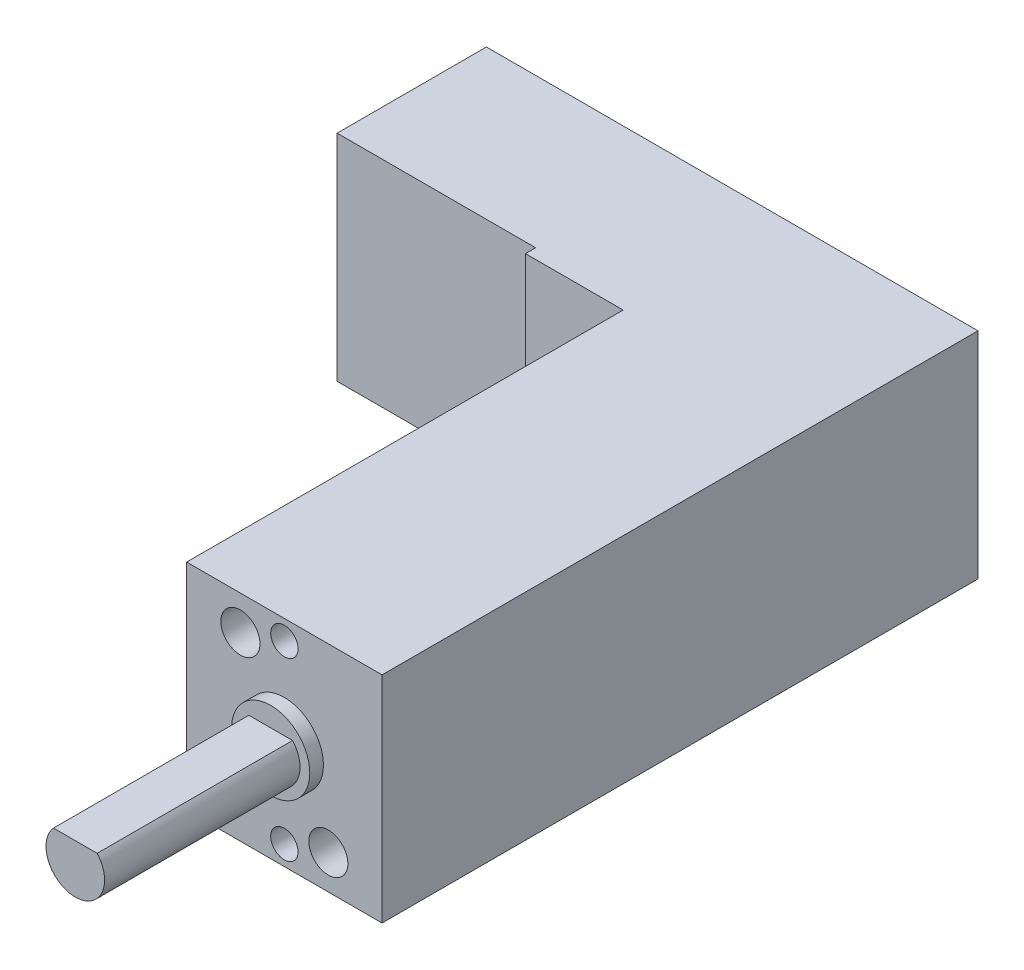
ISO-10303-21;
HEADER;
FILE_DESCRIPTION(('STEP AP214'),'2;1');
FILE_NAME('part.step','',(''),(''),'','','');
FILE_SCHEMA(('AUTOMOTIVE_DESIGN { 1 0 10303 214 1 1 1 1 }'));
ENDSEC;
DATA;
#1=APPLICATION_CONTEXT('core data for automotive mechanical design processes');
#2=APPLICATION_PROTOCOL_DEFINITION('international standard','automotive_design',2000,#1);
#3=PRODUCT_CONTEXT('',#1,'mechanical');
#4=PRODUCT('Part','Part','',(#3));
#5=PRODUCT_RELATED_PRODUCT_CATEGORY('part','',(#4));
#6=PRODUCT_DEFINITION_FORMATION('','',#4);
#7=PRODUCT_DEFINITION_CONTEXT('part definition',#1,'design');
#8=PRODUCT_DEFINITION('design','',#6,#7);
#9=PRODUCT_DEFINITION_SHAPE('','',#8);
#10=(LENGTH_UNIT() NAMED_UNIT(*) SI_UNIT(.MILLI.,.METRE.));
#11=(NAMED_UNIT(*) PLANE_ANGLE_UNIT() SI_UNIT($,.RADIAN.));
#12=(NAMED_UNIT(*) SI_UNIT($,.STERADIAN.) SOLID_ANGLE_UNIT());
#13=UNCERTAINTY_MEASURE_WITH_UNIT(LENGTH_MEASURE(1.E-05),#10,'distance_accuracy_value','');
#14=(GEOMETRIC_REPRESENTATION_CONTEXT(3) GLOBAL_UNCERTAINTY_ASSIGNED_CONTEXT((#13)) GLOBAL_UNIT_ASSIGNED_CONTEXT((#10,
#11,#12)) REPRESENTATION_CONTEXT('',''));
#15=CARTESIAN_POINT('',(0.,0.,0.));
#16=DIRECTION('',(0.,0.,1.));
#17=DIRECTION('',(1.,0.,0.));
#18=AXIS2_PLACEMENT_3D('',#15,#16,#17);
#19=CARTESIAN_POINT('',(-7.5,5.5,21.5));
#20=DIRECTION('',(1.,0.,0.));
#21=DIRECTION('',(0.,0.,-1.));
#22=AXIS2_PLACEMENT_3D('',#19,#20,#21);
#23=PLANE('',#22);
#24=DIRECTION('',(0.,0.,-1.));
#25=VECTOR('',#24,1.);
#26=CARTESIAN_POINT('',(-7.5,-5.5,21.5));
#27=LINE('',#26,#25);
#28=CARTESIAN_POINT('',(-7.5,-5.5,8.16000259983953));
#29=VERTEX_POINT('',#28);
#30=CARTESIAN_POINT('',(-7.5,-5.5,7.64));
#31=VERTEX_POINT('',#30);
#32=EDGE_CURVE('E51',#29,#31,#27,.T.);
#33=ORIENTED_EDGE('',*,*,#32,.F.);
#34=DIRECTION('',(0.,-1.,0.));
#35=VECTOR('',#34,1.);
#36=CARTESIAN_POINT('',(-7.5,19.7462461945696,8.16000259983953));
#37=LINE('',#36,#35);
#38=CARTESIAN_POINT('',(-7.5,5.5,8.16000259983953));
#39=VERTEX_POINT('',#38);
#40=EDGE_CURVE('E115',#39,#29,#37,.T.);
#41=ORIENTED_EDGE('',*,*,#40,.F.);
#42=DIRECTION('',(0.,0.,-1.));
#43=VECTOR('',#42,1.);
#44=CARTESIAN_POINT('',(-7.5,5.5,21.5));
#45=LINE('',#44,#43);
#46=CARTESIAN_POINT('',(-7.5,5.5,7.64));
#47=VERTEX_POINT('',#46);
#48=EDGE_CURVE('E133',#39,#47,#45,.T.);
#49=ORIENTED_EDGE('',*,*,#48,.T.);
#50=DIRECTION('',(0.,1.,0.));
#51=VECTOR('',#50,1.);
#52=CARTESIAN_POINT('',(-7.5,5.5,7.64));
#53=LINE('',#52,#51);
#54=EDGE_CURVE('E131',#31,#47,#53,.T.);
#55=ORIENTED_EDGE('',*,*,#54,.F.);
#56=EDGE_LOOP('',(#33,#41,#49,#55));
#57=FACE_BOUND('',#56,.T.);
#58=ADVANCED_FACE('F34',(#57),#23,.F.);
#59=CARTESIAN_POINT('',(-7.5,-5.5,21.5));
#60=DIRECTION('',(0.,1.,0.));
#61=DIRECTION('',(0.,0.,1.));
#62=AXIS2_PLACEMENT_3D('',#59,#60,#61);
#63=PLANE('',#62);
#64=DIRECTION('',(0.,0.,-1.));
#65=VECTOR('',#64,1.);
#66=CARTESIAN_POINT('',(-2.5,-5.5,30.5));
#67=LINE('',#66,#65);
#68=CARTESIAN_POINT('',(-2.5,-5.5,30.5));
#69=VERTEX_POINT('',#68);
#70=CARTESIAN_POINT('',(-2.5,-5.5,8.16000259983953));
#71=VERTEX_POINT('',#70);
#72=EDGE_CURVE('E127',#69,#71,#67,.T.);
#73=ORIENTED_EDGE('',*,*,#72,.T.);
#74=DIRECTION('',(1.,0.,0.));
#75=VECTOR('',#74,1.);
#76=CARTESIAN_POINT('',(-7.5,-5.5,8.16000259983953));
#77=LINE('',#76,#75);
#78=EDGE_CURVE('E118',#29,#71,#77,.T.);
#79=ORIENTED_EDGE('',*,*,#78,.F.);
#80=ORIENTED_EDGE('',*,*,#32,.T.);
#81=DIRECTION('',(1.,0.,0.));
#82=VECTOR('',#81,1.);
#83=CARTESIAN_POINT('',(-17.66,-5.5,7.64));
#84=LINE('',#83,#82);
#85=CARTESIAN_POINT('',(-17.66,-5.5,7.64));
#86=VERTEX_POINT('',#85);
#87=EDGE_CURVE('E194',#86,#31,#84,.T.);
#88=ORIENTED_EDGE('',*,*,#87,.F.);
#89=DIRECTION('',(0.,0.,1.));
#90=VECTOR('',#89,1.);
#91=CARTESIAN_POINT('',(-17.66,-5.5,0.));
#92=LINE('',#91,#90);
#93=CARTESIAN_POINT('',(-17.66,-5.5,0.));
#94=VERTEX_POINT('',#93);
#95=EDGE_CURVE('E185',#94,#86,#92,.T.);
#96=ORIENTED_EDGE('',*,*,#95,.F.);
#97=DIRECTION('',(1.,0.,0.));
#98=VECTOR('',#97,1.);
#99=CARTESIAN_POINT('',(-7.5,-5.5,0.));
#100=LINE('',#99,#98);
#101=CARTESIAN_POINT('',(7.5,-5.5,0.));
#102=VERTEX_POINT('',#101);
#103=EDGE_CURVE('E169',#94,#102,#100,.T.);
#104=ORIENTED_EDGE('',*,*,#103,.T.);
#105=DIRECTION('',(0.,0.,-1.));
#106=VECTOR('',#105,1.);
#107=CARTESIAN_POINT('',(7.5,-5.5,21.5));
#108=LINE('',#107,#106);
#109=CARTESIAN_POINT('',(7.5,-5.5,30.5));
#110=VERTEX_POINT('',#109);
#111=EDGE_CURVE('E38',#110,#102,#108,.T.);
#112=ORIENTED_EDGE('',*,*,#111,.F.);
#113=DIRECTION('',(1.,0.,0.));
#114=VECTOR('',#113,1.);
#115=CARTESIAN_POINT('',(-2.5,-5.5,30.5));
#116=LINE('',#115,#114);
#117=EDGE_CURVE('E163',#69,#110,#116,.T.);
#118=ORIENTED_EDGE('',*,*,#117,.F.);
#119=EDGE_LOOP('',(#73,#79,#80,#88,#96,#104,#112,#118));
#120=FACE_BOUND('',#119,.T.);
#121=ADVANCED_FACE('F36',(#120),#63,.F.);
#122=CARTESIAN_POINT('',(7.5,5.5,21.5));
#123=DIRECTION('',(-1.,0.,0.));
#124=DIRECTION('',(0.,0.,1.));
#125=AXIS2_PLACEMENT_3D('',#122,#123,#124);
#126=PLANE('',#125);
#127=DIRECTION('',(0.,1.,0.));
#128=VECTOR('',#127,1.);
#129=CARTESIAN_POINT('',(7.5,5.5,0.));
#130=LINE('',#129,#128);
#131=CARTESIAN_POINT('',(7.5,5.5,0.));
#132=VERTEX_POINT('',#131);
#133=EDGE_CURVE('E138',#102,#132,#130,.T.);
#134=ORIENTED_EDGE('',*,*,#133,.T.);
#135=DIRECTION('',(0.,0.,-1.));
#136=VECTOR('',#135,1.);
#137=CARTESIAN_POINT('',(7.5,5.5,21.5));
#138=LINE('',#137,#136);
#139=CARTESIAN_POINT('',(7.5,5.5,30.5));
#140=VERTEX_POINT('',#139);
#141=EDGE_CURVE('E136',#140,#132,#138,.T.);
#142=ORIENTED_EDGE('',*,*,#141,.F.);
#143=DIRECTION('',(0.,1.,0.));
#144=VECTOR('',#143,1.);
#145=CARTESIAN_POINT('',(7.5,-5.5,30.5));
#146=LINE('',#145,#144);
#147=EDGE_CURVE('E156',#110,#140,#146,.T.);
#148=ORIENTED_EDGE('',*,*,#147,.F.);
#149=ORIENTED_EDGE('',*,*,#111,.T.);
#150=EDGE_LOOP('',(#134,#142,#148,#149));
#151=FACE_BOUND('',#150,.T.);
#152=ADVANCED_FACE('F170',(#151),#126,.F.);
#153=CARTESIAN_POINT('',(-7.5,5.5,21.5));
#154=DIRECTION('',(0.,-1.,0.));
#155=DIRECTION('',(0.,0.,-1.));
#156=AXIS2_PLACEMENT_3D('',#153,#154,#155);
#157=PLANE('',#156);
#158=DIRECTION('',(-1.,0.,0.));
#159=VECTOR('',#158,1.);
#160=CARTESIAN_POINT('',(-7.5,5.5,8.16000259983953));
#161=LINE('',#160,#159);
#162=CARTESIAN_POINT('',(-2.5,5.5,8.16000259983953));
#163=VERTEX_POINT('',#162);
#164=EDGE_CURVE('E120',#163,#39,#161,.T.);
#165=ORIENTED_EDGE('',*,*,#164,.F.);
#166=DIRECTION('',(0.,0.,-1.));
#167=VECTOR('',#166,1.);
#168=CARTESIAN_POINT('',(-2.5,5.5,30.5));
#169=LINE('',#168,#167);
#170=CARTESIAN_POINT('',(-2.5,5.5,30.5));
#171=VERTEX_POINT('',#170);
#172=EDGE_CURVE('E167',#171,#163,#169,.T.);
#173=ORIENTED_EDGE('',*,*,#172,.F.);
#174=DIRECTION('',(-1.,0.,0.));
#175=VECTOR('',#174,1.);
#176=CARTESIAN_POINT('',(7.5,5.5,30.5));
#177=LINE('',#176,#175);
#178=EDGE_CURVE('E159',#140,#171,#177,.T.);
#179=ORIENTED_EDGE('',*,*,#178,.F.);
#180=ORIENTED_EDGE('',*,*,#141,.T.);
#181=DIRECTION('',(-1.,0.,0.));
#182=VECTOR('',#181,1.);
#183=CARTESIAN_POINT('',(-7.5,5.5,0.));
#184=LINE('',#183,#182);
#185=CARTESIAN_POINT('',(-17.66,5.5,0.));
#186=VERTEX_POINT('',#185);
#187=EDGE_CURVE('E134',#132,#186,#184,.T.);
#188=ORIENTED_EDGE('',*,*,#187,.T.);
#189=DIRECTION('',(0.,0.,-1.));
#190=VECTOR('',#189,1.);
#191=CARTESIAN_POINT('',(-17.66,5.5,7.64));
#192=LINE('',#191,#190);
#193=CARTESIAN_POINT('',(-17.66,5.5,7.64));
#194=VERTEX_POINT('',#193);
#195=EDGE_CURVE('E180',#194,#186,#192,.T.);
#196=ORIENTED_EDGE('',*,*,#195,.F.);
#197=DIRECTION('',(1.,0.,0.));
#198=VECTOR('',#197,1.);
#199=CARTESIAN_POINT('',(-17.66,5.5,7.64));
#200=LINE('',#199,#198);
#201=EDGE_CURVE('E182',#194,#47,#200,.T.);
#202=ORIENTED_EDGE('',*,*,#201,.T.);
#203=ORIENTED_EDGE('',*,*,#48,.F.);
#204=EDGE_LOOP('',(#165,#173,#179,#180,#188,#196,#202,#203));
#205=FACE_BOUND('',#204,.T.);
#206=ADVANCED_FACE('F178',(#205),#157,.F.);
#207=CARTESIAN_POINT('',(0.,0.,0.));
#208=DIRECTION('',(0.,0.,-1.));
#209=DIRECTION('',(-1.,0.,0.));
#210=AXIS2_PLACEMENT_3D('',#207,#208,#209);
#211=PLANE('',#210);
#212=ORIENTED_EDGE('',*,*,#103,.F.);
#213=DIRECTION('',(0.,-1.,0.));
#214=VECTOR('',#213,1.);
#215=CARTESIAN_POINT('',(-17.66,5.5,0.));
#216=LINE('',#215,#214);
#217=EDGE_CURVE('E175',#186,#94,#216,.T.);
#218=ORIENTED_EDGE('',*,*,#217,.F.);
#219=ORIENTED_EDGE('',*,*,#187,.F.);
#220=ORIENTED_EDGE('',*,*,#133,.F.);
#221=EDGE_LOOP('',(#212,#218,#219,#220));
#222=FACE_BOUND('',#221,.T.);
#223=ADVANCED_FACE('F172',(#222),#211,.T.);
#224=CARTESIAN_POINT('',(-2.5,-5.5,30.5));
#225=DIRECTION('',(1.,0.,0.));
#226=DIRECTION('',(0.,1.,0.));
#227=AXIS2_PLACEMENT_3D('',#224,#225,#226);
#228=PLANE('',#227);
#229=ORIENTED_EDGE('',*,*,#172,.T.);
#230=DIRECTION('',(0.,-1.,0.));
#231=VECTOR('',#230,1.);
#232=CARTESIAN_POINT('',(-2.5,19.7462461945696,8.16000259983953));
#233=LINE('',#232,#231);
#234=EDGE_CURVE('E123',#163,#71,#233,.T.);
#235=ORIENTED_EDGE('',*,*,#234,.T.);
#236=ORIENTED_EDGE('',*,*,#72,.F.);
#237=DIRECTION('',(0.,-1.,0.));
#238=VECTOR('',#237,1.);
#239=CARTESIAN_POINT('',(-2.5,-5.5,30.5));
#240=LINE('',#239,#238);
#241=EDGE_CURVE('E161',#171,#69,#240,.T.);
#242=ORIENTED_EDGE('',*,*,#241,.F.);
#243=EDGE_LOOP('',(#229,#235,#236,#242));
#244=FACE_BOUND('',#243,.T.);
#245=ADVANCED_FACE('F249',(#244),#228,.F.);
#246=CARTESIAN_POINT('',(0.,0.,30.5));
#247=DIRECTION('',(0.,0.,1.));
#248=DIRECTION('',(1.,0.,0.));
#249=AXIS2_PLACEMENT_3D('',#246,#247,#248);
#250=PLANE('',#249);
#251=CARTESIAN_POINT('',(0.249999999999999,3.75,30.5));
#252=DIRECTION('',(0.,0.,1.));
#253=DIRECTION('',(1.,0.,0.));
#254=AXIS2_PLACEMENT_3D('',#251,#252,#253);
#255=CIRCLE('',#254,1.);
#256=CARTESIAN_POINT('',(1.25,3.75,30.5));
#257=VERTEX_POINT('',#256);
#258=EDGE_CURVE('E196',#257,#257,#255,.T.);
#259=ORIENTED_EDGE('',*,*,#258,.F.);
#260=EDGE_LOOP('',(#259));
#261=FACE_BOUND('',#260,.T.);
#262=CARTESIAN_POINT('',(4.75,-3.75,30.5));
#263=DIRECTION('',(0.,0.,1.));
#264=DIRECTION('',(1.,0.,0.));
#265=AXIS2_PLACEMENT_3D('',#262,#263,#264);
#266=CIRCLE('',#265,1.);
#267=CARTESIAN_POINT('',(5.75,-3.75,30.5));
#268=VERTEX_POINT('',#267);
#269=EDGE_CURVE('E207',#268,#268,#266,.T.);
#270=ORIENTED_EDGE('',*,*,#269,.F.);
#271=EDGE_LOOP('',(#270));
#272=FACE_BOUND('',#271,.T.);
#273=CARTESIAN_POINT('',(2.5,-4.5,30.5));
#274=DIRECTION('',(0.,0.,1.));
#275=DIRECTION('',(-1.,0.,0.));
#276=AXIS2_PLACEMENT_3D('',#273,#274,#275);
#277=CIRCLE('',#276,0.7);
#278=CARTESIAN_POINT('',(1.8,-4.5,30.5));
#279=VERTEX_POINT('',#278);
#280=EDGE_CURVE('E201',#279,#279,#277,.T.);
#281=ORIENTED_EDGE('',*,*,#280,.F.);
#282=EDGE_LOOP('',(#281));
#283=FACE_BOUND('',#282,.T.);
#284=CARTESIAN_POINT('',(2.5,4.5,30.5));
#285=DIRECTION('',(0.,0.,1.));
#286=DIRECTION('',(1.,0.,0.));
#287=AXIS2_PLACEMENT_3D('',#284,#285,#286);
#288=CIRCLE('',#287,0.7);
#289=CARTESIAN_POINT('',(3.2,4.5,30.5));
#290=VERTEX_POINT('',#289);
#291=EDGE_CURVE('E200',#290,#290,#288,.T.);
#292=ORIENTED_EDGE('',*,*,#291,.F.);
#293=EDGE_LOOP('',(#292));
#294=FACE_BOUND('',#293,.T.);
#295=CARTESIAN_POINT('',(2.5,0.,30.5));
#296=DIRECTION('',(0.,0.,1.));
#297=DIRECTION('',(1.,0.,0.));
#298=AXIS2_PLACEMENT_3D('',#295,#296,#297);
#299=CIRCLE('',#298,2.);
#300=CARTESIAN_POINT('',(4.5,0.,30.5));
#301=VERTEX_POINT('',#300);
#302=EDGE_CURVE('E43',#301,#301,#299,.T.);
#303=ORIENTED_EDGE('',*,*,#302,.F.);
#304=EDGE_LOOP('',(#303));
#305=FACE_BOUND('',#304,.T.);
#306=ORIENTED_EDGE('',*,*,#147,.T.);
#307=ORIENTED_EDGE('',*,*,#178,.T.);
#308=ORIENTED_EDGE('',*,*,#241,.T.);
#309=ORIENTED_EDGE('',*,*,#117,.T.);
#310=EDGE_LOOP('',(#306,#307,#308,#309));
#311=FACE_BOUND('',#310,.T.);
#312=ADVANCED_FACE('F240',(#261,#272,#283,#294,#305,#311),#250,.T.);
#313=CARTESIAN_POINT('',(2.5,0.,31.2));
#314=DIRECTION('',(0.,0.,-1.));
#315=DIRECTION('',(-1.,0.,0.));
#316=AXIS2_PLACEMENT_3D('',#313,#314,#315);
#317=CYLINDRICAL_SURFACE('',#316,2.);
#318=CARTESIAN_POINT('',(2.5,0.,31.2));
#319=DIRECTION('',(0.,0.,1.));
#320=DIRECTION('',(1.,0.,0.));
#321=AXIS2_PLACEMENT_3D('',#318,#319,#320);
#322=CIRCLE('',#321,2.);
#323=CARTESIAN_POINT('',(4.5,0.,31.2));
#324=VERTEX_POINT('',#323);
#325=EDGE_CURVE('E155',#324,#324,#322,.T.);
#326=ORIENTED_EDGE('',*,*,#325,.F.);
#327=EDGE_LOOP('',(#326));
#328=FACE_BOUND('',#327,.T.);
#329=ORIENTED_EDGE('',*,*,#302,.T.);
#330=EDGE_LOOP('',(#329));
#331=FACE_BOUND('',#330,.T.);
#332=ADVANCED_FACE('F238',(#328,#331),#317,.T.);
#333=CARTESIAN_POINT('',(2.5,0.,31.2));
#334=DIRECTION('',(0.,0.,1.));
#335=DIRECTION('',(1.,0.,0.));
#336=AXIS2_PLACEMENT_3D('',#333,#334,#335);
#337=PLANE('',#336);
#338=CARTESIAN_POINT('',(2.5,0.,31.2));
#339=DIRECTION('',(0.,0.,1.));
#340=DIRECTION('',(1.,0.,0.));
#341=AXIS2_PLACEMENT_3D('',#338,#339,#340);
#342=CIRCLE('',#341,1.5);
#343=CARTESIAN_POINT('',(1.38196601125011,1.,31.2));
#344=VERTEX_POINT('',#343);
#345=CARTESIAN_POINT('',(3.61803398874989,1.,31.2));
#346=VERTEX_POINT('',#345);
#347=EDGE_CURVE('E11',#344,#346,#342,.T.);
#348=ORIENTED_EDGE('',*,*,#347,.F.);
#349=DIRECTION('',(1.,0.,0.));
#350=VECTOR('',#349,1.);
#351=CARTESIAN_POINT('',(1.38196601125011,1.,31.2));
#352=LINE('',#351,#350);
#353=EDGE_CURVE('E221',#344,#346,#352,.T.);
#354=ORIENTED_EDGE('',*,*,#353,.T.);
#355=EDGE_LOOP('',(#348,#354));
#356=FACE_BOUND('',#355,.T.);
#357=ORIENTED_EDGE('',*,*,#325,.T.);
#358=EDGE_LOOP('',(#357));
#359=FACE_BOUND('',#358,.T.);
#360=ADVANCED_FACE('F236',(#356,#359),#337,.T.);
#361=CARTESIAN_POINT('',(2.5,0.,41.2));
#362=DIRECTION('',(0.,0.,-1.));
#363=DIRECTION('',(-1.,0.,0.));
#364=AXIS2_PLACEMENT_3D('',#361,#362,#363);
#365=CYLINDRICAL_SURFACE('',#364,1.5);
#366=CARTESIAN_POINT('',(2.5,0.,41.2));
#367=DIRECTION('',(0.,0.,1.));
#368=DIRECTION('',(1.,0.,0.));
#369=AXIS2_PLACEMENT_3D('',#366,#367,#368);
#370=CIRCLE('',#369,1.5);
#371=CARTESIAN_POINT('',(1.38196601125011,1.,41.2));
#372=VERTEX_POINT('',#371);
#373=CARTESIAN_POINT('',(3.61803398874989,1.,41.2));
#374=VERTEX_POINT('',#373);
#375=EDGE_CURVE('E228',#372,#374,#370,.T.);
#376=ORIENTED_EDGE('',*,*,#375,.F.);
#377=DIRECTION('',(0.,0.,1.));
#378=VECTOR('',#377,1.);
#379=CARTESIAN_POINT('',(1.38196601125011,1.,31.2));
#380=LINE('',#379,#378);
#381=EDGE_CURVE('E59',#344,#372,#380,.T.);
#382=ORIENTED_EDGE('',*,*,#381,.F.);
#383=ORIENTED_EDGE('',*,*,#347,.T.);
#384=DIRECTION('',(0.,0.,1.));
#385=VECTOR('',#384,1.);
#386=CARTESIAN_POINT('',(3.61803398874989,1.,31.2));
#387=LINE('',#386,#385);
#388=EDGE_CURVE('E225',#346,#374,#387,.T.);
#389=ORIENTED_EDGE('',*,*,#388,.T.);
#390=EDGE_LOOP('',(#376,#382,#383,#389));
#391=FACE_BOUND('',#390,.T.);
#392=ADVANCED_FACE('F246',(#391),#365,.T.);
#393=CARTESIAN_POINT('',(2.5,0.,41.2));
#394=DIRECTION('',(0.,0.,1.));
#395=DIRECTION('',(1.,0.,0.));
#396=AXIS2_PLACEMENT_3D('',#393,#394,#395);
#397=PLANE('',#396);
#398=DIRECTION('',(1.,0.,0.));
#399=VECTOR('',#398,1.);
#400=CARTESIAN_POINT('',(1.38196601125011,1.,41.2));
#401=LINE('',#400,#399);
#402=EDGE_CURVE('E218',#372,#374,#401,.T.);
#403=ORIENTED_EDGE('',*,*,#402,.F.);
#404=ORIENTED_EDGE('',*,*,#375,.T.);
#405=EDGE_LOOP('',(#403,#404));
#406=FACE_BOUND('',#405,.T.);
#407=ADVANCED_FACE('F442',(#406),#397,.T.);
#408=CARTESIAN_POINT('',(1.38196601125011,1.,31.2));
#409=DIRECTION('',(0.,-1.,0.));
#410=DIRECTION('',(0.,0.,-1.));
#411=AXIS2_PLACEMENT_3D('',#408,#409,#410);
#412=PLANE('',#411);
#413=ORIENTED_EDGE('',*,*,#402,.T.);
#414=ORIENTED_EDGE('',*,*,#388,.F.);
#415=ORIENTED_EDGE('',*,*,#353,.F.);
#416=ORIENTED_EDGE('',*,*,#381,.T.);
#417=EDGE_LOOP('',(#413,#414,#415,#416));
#418=FACE_BOUND('',#417,.T.);
#419=ADVANCED_FACE('F296',(#418),#412,.F.);
#420=CARTESIAN_POINT('',(2.5,4.5,27.5));
#421=DIRECTION('',(0.,0.,1.));
#422=DIRECTION('',(1.,0.,0.));
#423=AXIS2_PLACEMENT_3D('',#420,#421,#422);
#424=CYLINDRICAL_SURFACE('',#423,0.7);
#425=CARTESIAN_POINT('',(2.5,4.5,27.5));
#426=DIRECTION('',(0.,0.,1.));
#427=DIRECTION('',(1.,0.,0.));
#428=AXIS2_PLACEMENT_3D('',#425,#426,#427);
#429=CIRCLE('',#428,0.7);
#430=CARTESIAN_POINT('',(3.2,4.5,27.5));
#431=VERTEX_POINT('',#430);
#432=EDGE_CURVE('E215',#431,#431,#429,.T.);
#433=ORIENTED_EDGE('',*,*,#432,.F.);
#434=EDGE_LOOP('',(#433));
#435=FACE_BOUND('',#434,.T.);
#436=ORIENTED_EDGE('',*,*,#291,.T.);
#437=EDGE_LOOP('',(#436));
#438=FACE_BOUND('',#437,.T.);
#439=ADVANCED_FACE('F301',(#435,#438),#424,.F.);
#440=CARTESIAN_POINT('',(2.5,4.5,27.5));
#441=DIRECTION('',(0.,0.,1.));
#442=DIRECTION('',(1.,0.,0.));
#443=AXIS2_PLACEMENT_3D('',#440,#441,#442);
#444=PLANE('',#443);
#445=ORIENTED_EDGE('',*,*,#432,.T.);
#446=EDGE_LOOP('',(#445));
#447=FACE_BOUND('',#446,.T.);
#448=ADVANCED_FACE('F306',(#447),#444,.T.);
#449=CARTESIAN_POINT('',(2.5,-4.5,27.5));
#450=DIRECTION('',(0.,0.,1.));
#451=DIRECTION('',(1.,0.,0.));
#452=AXIS2_PLACEMENT_3D('',#449,#450,#451);
#453=CYLINDRICAL_SURFACE('',#452,0.7);
#454=CARTESIAN_POINT('',(2.5,-4.5,27.5));
#455=DIRECTION('',(0.,0.,1.));
#456=DIRECTION('',(-1.,0.,0.));
#457=AXIS2_PLACEMENT_3D('',#454,#455,#456);
#458=CIRCLE('',#457,0.7);
#459=CARTESIAN_POINT('',(1.8,-4.5,27.5));
#460=VERTEX_POINT('',#459);
#461=EDGE_CURVE('E197',#460,#460,#458,.T.);
#462=ORIENTED_EDGE('',*,*,#461,.F.);
#463=EDGE_LOOP('',(#462));
#464=FACE_BOUND('',#463,.T.);
#465=ORIENTED_EDGE('',*,*,#280,.T.);
#466=EDGE_LOOP('',(#465));
#467=FACE_BOUND('',#466,.T.);
#468=ADVANCED_FACE('F316',(#464,#467),#453,.F.);
#469=CARTESIAN_POINT('',(2.5,-4.5,27.5));
#470=DIRECTION('',(0.,0.,-1.));
#471=DIRECTION('',(-1.,0.,0.));
#472=AXIS2_PLACEMENT_3D('',#469,#470,#471);
#473=PLANE('',#472);
#474=ORIENTED_EDGE('',*,*,#461,.T.);
#475=EDGE_LOOP('',(#474));
#476=FACE_BOUND('',#475,.T.);
#477=ADVANCED_FACE('F326',(#476),#473,.F.);
#478=CARTESIAN_POINT('',(4.75,-3.75,27.5));
#479=DIRECTION('',(0.,0.,1.));
#480=DIRECTION('',(1.,0.,0.));
#481=AXIS2_PLACEMENT_3D('',#478,#479,#480);
#482=CYLINDRICAL_SURFACE('',#481,1.);
#483=CARTESIAN_POINT('',(4.75,-3.75,27.5));
#484=DIRECTION('',(0.,0.,1.));
#485=DIRECTION('',(1.,0.,0.));
#486=AXIS2_PLACEMENT_3D('',#483,#484,#485);
#487=CIRCLE('',#486,1.);
#488=CARTESIAN_POINT('',(5.75,-3.75,27.5));
#489=VERTEX_POINT('',#488);
#490=EDGE_CURVE('E204',#489,#489,#487,.T.);
#491=ORIENTED_EDGE('',*,*,#490,.F.);
#492=EDGE_LOOP('',(#491));
#493=FACE_BOUND('',#492,.T.);
#494=ORIENTED_EDGE('',*,*,#269,.T.);
#495=EDGE_LOOP('',(#494));
#496=FACE_BOUND('',#495,.T.);
#497=ADVANCED_FACE('F336',(#493,#496),#482,.F.);
#498=CARTESIAN_POINT('',(4.75,-3.75,27.5));
#499=DIRECTION('',(0.,0.,1.));
#500=DIRECTION('',(1.,0.,0.));
#501=AXIS2_PLACEMENT_3D('',#498,#499,#500);
#502=PLANE('',#501);
#503=ORIENTED_EDGE('',*,*,#490,.T.);
#504=EDGE_LOOP('',(#503));
#505=FACE_BOUND('',#504,.T.);
#506=ADVANCED_FACE('F346',(#505),#502,.T.);
#507=CARTESIAN_POINT('',(0.249999999999999,3.75,27.5));
#508=DIRECTION('',(0.,0.,1.));
#509=DIRECTION('',(1.,0.,0.));
#510=AXIS2_PLACEMENT_3D('',#507,#508,#509);
#511=CYLINDRICAL_SURFACE('',#510,1.);
#512=CARTESIAN_POINT('',(0.249999999999999,3.75,27.5));
#513=DIRECTION('',(0.,0.,1.));
#514=DIRECTION('',(1.,0.,0.));
#515=AXIS2_PLACEMENT_3D('',#512,#513,#514);
#516=CIRCLE('',#515,1.);
#517=CARTESIAN_POINT('',(1.25,3.75,27.5));
#518=VERTEX_POINT('',#517);
#519=EDGE_CURVE('E210',#518,#518,#516,.T.);
#520=ORIENTED_EDGE('',*,*,#519,.F.);
#521=EDGE_LOOP('',(#520));
#522=FACE_BOUND('',#521,.T.);
#523=ORIENTED_EDGE('',*,*,#258,.T.);
#524=EDGE_LOOP('',(#523));
#525=FACE_BOUND('',#524,.T.);
#526=ADVANCED_FACE('F356',(#522,#525),#511,.F.);
#527=CARTESIAN_POINT('',(0.249999999999999,3.75,27.5));
#528=DIRECTION('',(0.,0.,1.));
#529=DIRECTION('',(1.,0.,0.));
#530=AXIS2_PLACEMENT_3D('',#527,#528,#529);
#531=PLANE('',#530);
#532=ORIENTED_EDGE('',*,*,#519,.T.);
#533=EDGE_LOOP('',(#532));
#534=FACE_BOUND('',#533,.T.);
#535=ADVANCED_FACE('F365',(#534),#531,.T.);
#536=CARTESIAN_POINT('',(-17.66,5.5,7.64));
#537=DIRECTION('',(0.,0.,-1.));
#538=DIRECTION('',(0.,1.,0.));
#539=AXIS2_PLACEMENT_3D('',#536,#537,#538);
#540=PLANE('',#539);
#541=ORIENTED_EDGE('',*,*,#54,.T.);
#542=ORIENTED_EDGE('',*,*,#201,.F.);
#543=DIRECTION('',(0.,1.,0.));
#544=VECTOR('',#543,1.);
#545=CARTESIAN_POINT('',(-17.66,5.5,7.64));
#546=LINE('',#545,#544);
#547=EDGE_CURVE('E191',#86,#194,#546,.T.);
#548=ORIENTED_EDGE('',*,*,#547,.F.);
#549=ORIENTED_EDGE('',*,*,#87,.T.);
#550=EDGE_LOOP('',(#541,#542,#548,#549));
#551=FACE_BOUND('',#550,.T.);
#552=ADVANCED_FACE('F374',(#551),#540,.F.);
#553=CARTESIAN_POINT('',(-17.66,0.,0.));
#554=DIRECTION('',(-1.,0.,0.));
#555=DIRECTION('',(0.,0.,1.));
#556=AXIS2_PLACEMENT_3D('',#553,#554,#555);
#557=PLANE('',#556);
#558=ORIENTED_EDGE('',*,*,#195,.T.);
#559=ORIENTED_EDGE('',*,*,#217,.T.);
#560=ORIENTED_EDGE('',*,*,#95,.T.);
#561=ORIENTED_EDGE('',*,*,#547,.T.);
#562=EDGE_LOOP('',(#558,#559,#560,#561));
#563=FACE_BOUND('',#562,.T.);
#564=ADVANCED_FACE('F384',(#563),#557,.T.);
#565=CARTESIAN_POINT('',(-7.5,19.7462461945696,8.16000259983953));
#566=DIRECTION('',(0.,0.,-1.));
#567=DIRECTION('',(-1.,0.,0.));
#568=AXIS2_PLACEMENT_3D('',#565,#566,#567);
#569=PLANE('',#568);
#570=ORIENTED_EDGE('',*,*,#164,.T.);
#571=ORIENTED_EDGE('',*,*,#40,.T.);
#572=ORIENTED_EDGE('',*,*,#78,.T.);
#573=ORIENTED_EDGE('',*,*,#234,.F.);
#574=EDGE_LOOP('',(#570,#571,#572,#573));
#575=FACE_BOUND('',#574,.T.);
#576=ADVANCED_FACE('F116',(#575),#569,.F.);
#577=CLOSED_SHELL('',(#58,#121,#152,#206,#223,#245,#312,#332,#360,#392,#407,#419,#439,#448,#468,
#477,#497,#506,#526,#535,#552,#564,#576));
#578=MANIFOLD_SOLID_BREP('B2',#577);
#579=ADVANCED_BREP_SHAPE_REPRESENTATION('',(#18,#578),#14);
#580=SHAPE_DEFINITION_REPRESENTATION(#9,#579);
ENDSEC;
END-ISO-10303-21;
